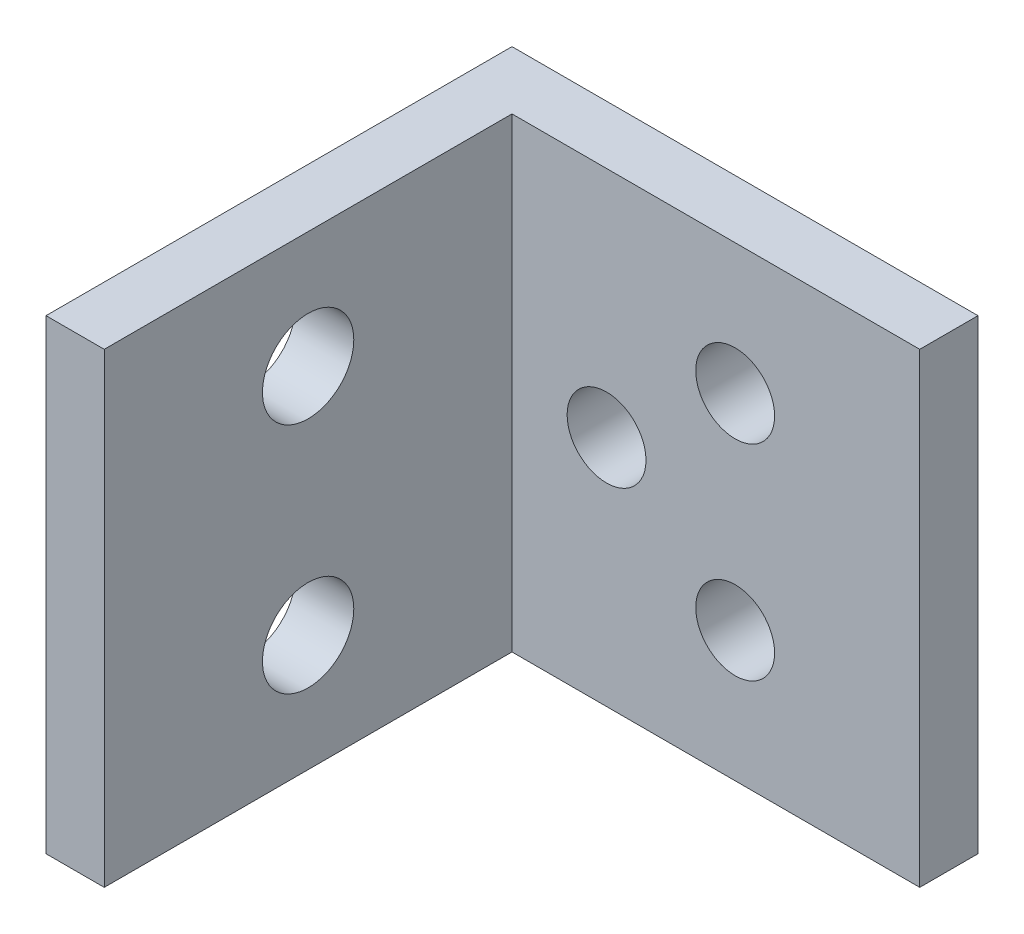
ISO-10303-21;
HEADER;
FILE_DESCRIPTION(('STEP AP214'),'2;1');
FILE_NAME('part.step','',(''),(''),'','','');
FILE_SCHEMA(('AUTOMOTIVE_DESIGN { 1 0 10303 214 1 1 1 1 }'));
ENDSEC;
DATA;
#1=APPLICATION_CONTEXT('core data for automotive mechanical design processes');
#2=APPLICATION_PROTOCOL_DEFINITION('international standard','automotive_design',2000,#1);
#3=PRODUCT_CONTEXT('',#1,'mechanical');
#4=PRODUCT('Part','Part','',(#3));
#5=PRODUCT_RELATED_PRODUCT_CATEGORY('part','',(#4));
#6=PRODUCT_DEFINITION_FORMATION('','',#4);
#7=PRODUCT_DEFINITION_CONTEXT('part definition',#1,'design');
#8=PRODUCT_DEFINITION('design','',#6,#7);
#9=PRODUCT_DEFINITION_SHAPE('','',#8);
#10=(LENGTH_UNIT() NAMED_UNIT(*) SI_UNIT(.MILLI.,.METRE.));
#11=(NAMED_UNIT(*) PLANE_ANGLE_UNIT() SI_UNIT($,.RADIAN.));
#12=(NAMED_UNIT(*) SI_UNIT($,.STERADIAN.) SOLID_ANGLE_UNIT());
#13=UNCERTAINTY_MEASURE_WITH_UNIT(LENGTH_MEASURE(1.E-05),#10,'distance_accuracy_value','');
#14=(GEOMETRIC_REPRESENTATION_CONTEXT(3) GLOBAL_UNCERTAINTY_ASSIGNED_CONTEXT((#13)) GLOBAL_UNIT_ASSIGNED_CONTEXT((#10,
#11,#12)) REPRESENTATION_CONTEXT('',''));
#15=CARTESIAN_POINT('',(0.,0.,0.));
#16=DIRECTION('',(0.,0.,1.));
#17=DIRECTION('',(1.,0.,0.));
#18=AXIS2_PLACEMENT_3D('',#15,#16,#17);
#19=CARTESIAN_POINT('',(0.,25.4,0.));
#20=DIRECTION('',(1.,0.,0.));
#21=DIRECTION('',(0.,0.,-1.));
#22=AXIS2_PLACEMENT_3D('',#19,#20,#21);
#23=PLANE('',#22);
#24=CARTESIAN_POINT('',(0.,6.35,14.2875));
#25=DIRECTION('',(1.,0.,0.));
#26=DIRECTION('',(0.,0.,-1.));
#27=AXIS2_PLACEMENT_3D('',#24,#25,#26);
#28=CIRCLE('',#27,2.4892);
#29=CARTESIAN_POINT('',(0.,6.35,11.7983));
#30=VERTEX_POINT('',#29);
#31=EDGE_CURVE('E183',#30,#30,#28,.T.);
#32=ORIENTED_EDGE('',*,*,#31,.T.);
#33=EDGE_LOOP('',(#32));
#34=FACE_BOUND('',#33,.T.);
#35=CARTESIAN_POINT('',(0.,19.05,14.2875));
#36=DIRECTION('',(1.,0.,0.));
#37=DIRECTION('',(0.,0.,-1.));
#38=AXIS2_PLACEMENT_3D('',#35,#36,#37);
#39=CIRCLE('',#38,2.4892);
#40=CARTESIAN_POINT('',(0.,19.05,11.7983));
#41=VERTEX_POINT('',#40);
#42=EDGE_CURVE('E186',#41,#41,#39,.T.);
#43=ORIENTED_EDGE('',*,*,#42,.T.);
#44=EDGE_LOOP('',(#43));
#45=FACE_BOUND('',#44,.T.);
#46=DIRECTION('',(0.,0.,1.));
#47=VECTOR('',#46,1.);
#48=CARTESIAN_POINT('',(0.,0.,0.));
#49=LINE('',#48,#47);
#50=CARTESIAN_POINT('',(0.,0.,0.));
#51=VERTEX_POINT('',#50);
#52=CARTESIAN_POINT('',(0.,0.,25.4));
#53=VERTEX_POINT('',#52);
#54=EDGE_CURVE('E125',#51,#53,#49,.T.);
#55=ORIENTED_EDGE('',*,*,#54,.T.);
#56=DIRECTION('',(0.,-1.,0.));
#57=VECTOR('',#56,1.);
#58=CARTESIAN_POINT('',(0.,25.4,25.4));
#59=LINE('',#58,#57);
#60=CARTESIAN_POINT('',(0.,25.4,25.4));
#61=VERTEX_POINT('',#60);
#62=EDGE_CURVE('E11',#61,#53,#59,.T.);
#63=ORIENTED_EDGE('',*,*,#62,.F.);
#64=DIRECTION('',(0.,0.,1.));
#65=VECTOR('',#64,1.);
#66=CARTESIAN_POINT('',(0.,25.4,0.));
#67=LINE('',#66,#65);
#68=CARTESIAN_POINT('',(0.,25.4,0.));
#69=VERTEX_POINT('',#68);
#70=EDGE_CURVE('E86',#69,#61,#67,.T.);
#71=ORIENTED_EDGE('',*,*,#70,.F.);
#72=DIRECTION('',(0.,-1.,0.));
#73=VECTOR('',#72,1.);
#74=CARTESIAN_POINT('',(0.,25.4,0.));
#75=LINE('',#74,#73);
#76=EDGE_CURVE('E121',#69,#51,#75,.T.);
#77=ORIENTED_EDGE('',*,*,#76,.T.);
#78=EDGE_LOOP('',(#55,#63,#71,#77));
#79=FACE_BOUND('',#78,.T.);
#80=ADVANCED_FACE('F39',(#34,#45,#79),#23,.F.);
#81=CARTESIAN_POINT('',(3.175,25.4,25.4));
#82=DIRECTION('',(0.,0.,1.));
#83=DIRECTION('',(1.,0.,0.));
#84=AXIS2_PLACEMENT_3D('',#81,#82,#83);
#85=PLANE('',#84);
#86=DIRECTION('',(-1.,0.,0.));
#87=VECTOR('',#86,1.);
#88=CARTESIAN_POINT('',(3.175,0.,25.4));
#89=LINE('',#88,#87);
#90=CARTESIAN_POINT('',(3.175,0.,25.4));
#91=VERTEX_POINT('',#90);
#92=EDGE_CURVE('E129',#91,#53,#89,.T.);
#93=ORIENTED_EDGE('',*,*,#92,.F.);
#94=DIRECTION('',(0.,-1.,0.));
#95=VECTOR('',#94,1.);
#96=CARTESIAN_POINT('',(3.175,25.4,25.4));
#97=LINE('',#96,#95);
#98=CARTESIAN_POINT('',(3.175,25.4,25.4));
#99=VERTEX_POINT('',#98);
#100=EDGE_CURVE('E48',#99,#91,#97,.T.);
#101=ORIENTED_EDGE('',*,*,#100,.F.);
#102=DIRECTION('',(-1.,0.,0.));
#103=VECTOR('',#102,1.);
#104=CARTESIAN_POINT('',(3.175,25.4,25.4));
#105=LINE('',#104,#103);
#106=EDGE_CURVE('E225',#99,#61,#105,.T.);
#107=ORIENTED_EDGE('',*,*,#106,.T.);
#108=ORIENTED_EDGE('',*,*,#62,.T.);
#109=EDGE_LOOP('',(#93,#101,#107,#108));
#110=FACE_BOUND('',#109,.T.);
#111=ADVANCED_FACE('F157',(#110),#85,.T.);
#112=CARTESIAN_POINT('',(3.175,25.4,0.));
#113=DIRECTION('',(1.,0.,0.));
#114=DIRECTION('',(0.,0.,-1.));
#115=AXIS2_PLACEMENT_3D('',#112,#113,#114);
#116=PLANE('',#115);
#117=CARTESIAN_POINT('',(3.175,6.35,14.2875));
#118=DIRECTION('',(1.,0.,0.));
#119=DIRECTION('',(0.,0.,-1.));
#120=AXIS2_PLACEMENT_3D('',#117,#118,#119);
#121=CIRCLE('',#120,2.4892);
#122=CARTESIAN_POINT('',(3.175,6.35,11.7983));
#123=VERTEX_POINT('',#122);
#124=EDGE_CURVE('E189',#123,#123,#121,.T.);
#125=ORIENTED_EDGE('',*,*,#124,.F.);
#126=EDGE_LOOP('',(#125));
#127=FACE_BOUND('',#126,.T.);
#128=CARTESIAN_POINT('',(3.175,19.05,14.2875));
#129=DIRECTION('',(1.,0.,0.));
#130=DIRECTION('',(0.,0.,-1.));
#131=AXIS2_PLACEMENT_3D('',#128,#129,#130);
#132=CIRCLE('',#131,2.4892);
#133=CARTESIAN_POINT('',(3.175,19.05,11.7983));
#134=VERTEX_POINT('',#133);
#135=EDGE_CURVE('E190',#134,#134,#132,.T.);
#136=ORIENTED_EDGE('',*,*,#135,.F.);
#137=EDGE_LOOP('',(#136));
#138=FACE_BOUND('',#137,.T.);
#139=DIRECTION('',(0.,0.,-1.));
#140=VECTOR('',#139,1.);
#141=CARTESIAN_POINT('',(3.175,0.,0.));
#142=LINE('',#141,#140);
#143=CARTESIAN_POINT('',(3.175,0.,3.175));
#144=VERTEX_POINT('',#143);
#145=EDGE_CURVE('E134',#144,#91,#142,.F.);
#146=ORIENTED_EDGE('',*,*,#145,.F.);
#147=DIRECTION('',(0.,-1.,0.));
#148=VECTOR('',#147,1.);
#149=CARTESIAN_POINT('',(3.175,25.4,3.175));
#150=LINE('',#149,#148);
#151=CARTESIAN_POINT('',(3.175,25.4,3.175));
#152=VERTEX_POINT('',#151);
#153=EDGE_CURVE('E108',#152,#144,#150,.T.);
#154=ORIENTED_EDGE('',*,*,#153,.F.);
#155=DIRECTION('',(0.,0.,-1.));
#156=VECTOR('',#155,1.);
#157=CARTESIAN_POINT('',(3.175,25.4,0.));
#158=LINE('',#157,#156);
#159=EDGE_CURVE('E114',#152,#99,#158,.F.);
#160=ORIENTED_EDGE('',*,*,#159,.T.);
#161=ORIENTED_EDGE('',*,*,#100,.T.);
#162=EDGE_LOOP('',(#146,#154,#160,#161));
#163=FACE_BOUND('',#162,.T.);
#164=ADVANCED_FACE('F154',(#127,#138,#163),#116,.T.);
#165=CARTESIAN_POINT('',(0.,25.4,3.175));
#166=DIRECTION('',(0.,0.,1.));
#167=DIRECTION('',(1.,0.,0.));
#168=AXIS2_PLACEMENT_3D('',#165,#166,#167);
#169=PLANE('',#168);
#170=CARTESIAN_POINT('',(8.32866,12.7,3.175));
#171=DIRECTION('',(0.,0.,1.));
#172=DIRECTION('',(1.,0.,0.));
#173=AXIS2_PLACEMENT_3D('',#170,#171,#172);
#174=CIRCLE('',#173,2.14884);
#175=CARTESIAN_POINT('',(10.4775,12.7,3.175));
#176=VERTEX_POINT('',#175);
#177=EDGE_CURVE('E130',#176,#176,#174,.T.);
#178=ORIENTED_EDGE('',*,*,#177,.F.);
#179=EDGE_LOOP('',(#178));
#180=FACE_BOUND('',#179,.T.);
#181=CARTESIAN_POINT('',(15.33906,7.10946,3.175));
#182=DIRECTION('',(0.,0.,1.));
#183=DIRECTION('',(1.,0.,0.));
#184=AXIS2_PLACEMENT_3D('',#181,#182,#183);
#185=CIRCLE('',#184,2.14884);
#186=CARTESIAN_POINT('',(17.4879,7.10946,3.175));
#187=VERTEX_POINT('',#186);
#188=EDGE_CURVE('E216',#187,#187,#185,.T.);
#189=ORIENTED_EDGE('',*,*,#188,.F.);
#190=EDGE_LOOP('',(#189));
#191=FACE_BOUND('',#190,.T.);
#192=CARTESIAN_POINT('',(15.33906,18.29054,3.175));
#193=DIRECTION('',(0.,0.,1.));
#194=DIRECTION('',(1.,0.,0.));
#195=AXIS2_PLACEMENT_3D('',#192,#193,#194);
#196=CIRCLE('',#195,2.14884);
#197=CARTESIAN_POINT('',(17.4879,18.29054,3.175));
#198=VERTEX_POINT('',#197);
#199=EDGE_CURVE('E204',#198,#198,#196,.T.);
#200=ORIENTED_EDGE('',*,*,#199,.F.);
#201=EDGE_LOOP('',(#200));
#202=FACE_BOUND('',#201,.T.);
#203=DIRECTION('',(1.,0.,0.));
#204=VECTOR('',#203,1.);
#205=CARTESIAN_POINT('',(0.,0.,3.175));
#206=LINE('',#205,#204);
#207=CARTESIAN_POINT('',(25.4,0.,3.175));
#208=VERTEX_POINT('',#207);
#209=EDGE_CURVE('E102',#208,#144,#206,.F.);
#210=ORIENTED_EDGE('',*,*,#209,.F.);
#211=DIRECTION('',(0.,-1.,0.));
#212=VECTOR('',#211,1.);
#213=CARTESIAN_POINT('',(25.4,25.4,3.175));
#214=LINE('',#213,#212);
#215=CARTESIAN_POINT('',(25.4,25.4,3.175));
#216=VERTEX_POINT('',#215);
#217=EDGE_CURVE('E97',#216,#208,#214,.T.);
#218=ORIENTED_EDGE('',*,*,#217,.F.);
#219=DIRECTION('',(1.,0.,0.));
#220=VECTOR('',#219,1.);
#221=CARTESIAN_POINT('',(0.,25.4,3.175));
#222=LINE('',#221,#220);
#223=EDGE_CURVE('E100',#216,#152,#222,.F.);
#224=ORIENTED_EDGE('',*,*,#223,.T.);
#225=ORIENTED_EDGE('',*,*,#153,.T.);
#226=EDGE_LOOP('',(#210,#218,#224,#225));
#227=FACE_BOUND('',#226,.T.);
#228=ADVANCED_FACE('F99',(#180,#191,#202,#227),#169,.T.);
#229=CARTESIAN_POINT('',(25.4,25.4,0.));
#230=DIRECTION('',(1.,0.,0.));
#231=DIRECTION('',(0.,0.,-1.));
#232=AXIS2_PLACEMENT_3D('',#229,#230,#231);
#233=PLANE('',#232);
#234=DIRECTION('',(0.,0.,1.));
#235=VECTOR('',#234,1.);
#236=CARTESIAN_POINT('',(25.4,0.,0.));
#237=LINE('',#236,#235);
#238=CARTESIAN_POINT('',(25.4,0.,0.));
#239=VERTEX_POINT('',#238);
#240=EDGE_CURVE('E140',#239,#208,#237,.T.);
#241=ORIENTED_EDGE('',*,*,#240,.F.);
#242=DIRECTION('',(0.,-1.,0.));
#243=VECTOR('',#242,1.);
#244=CARTESIAN_POINT('',(25.4,25.4,0.));
#245=LINE('',#244,#243);
#246=CARTESIAN_POINT('',(25.4,25.4,0.));
#247=VERTEX_POINT('',#246);
#248=EDGE_CURVE('E77',#247,#239,#245,.T.);
#249=ORIENTED_EDGE('',*,*,#248,.F.);
#250=DIRECTION('',(0.,0.,1.));
#251=VECTOR('',#250,1.);
#252=CARTESIAN_POINT('',(25.4,25.4,0.));
#253=LINE('',#252,#251);
#254=EDGE_CURVE('E112',#247,#216,#253,.T.);
#255=ORIENTED_EDGE('',*,*,#254,.T.);
#256=ORIENTED_EDGE('',*,*,#217,.T.);
#257=EDGE_LOOP('',(#241,#249,#255,#256));
#258=FACE_BOUND('',#257,.T.);
#259=ADVANCED_FACE('F117',(#258),#233,.T.);
#260=CARTESIAN_POINT('',(0.,25.4,0.));
#261=DIRECTION('',(0.,0.,1.));
#262=DIRECTION('',(1.,0.,0.));
#263=AXIS2_PLACEMENT_3D('',#260,#261,#262);
#264=PLANE('',#263);
#265=CARTESIAN_POINT('',(8.32866,12.7,0.));
#266=DIRECTION('',(0.,0.,-1.));
#267=DIRECTION('',(-1.,0.,0.));
#268=AXIS2_PLACEMENT_3D('',#265,#266,#267);
#269=CIRCLE('',#268,2.14884);
#270=CARTESIAN_POINT('',(6.17982,12.7,0.));
#271=VERTEX_POINT('',#270);
#272=EDGE_CURVE('E200',#271,#271,#269,.T.);
#273=ORIENTED_EDGE('',*,*,#272,.F.);
#274=EDGE_LOOP('',(#273));
#275=FACE_BOUND('',#274,.T.);
#276=CARTESIAN_POINT('',(15.33906,7.10946,0.));
#277=DIRECTION('',(0.,0.,-1.));
#278=DIRECTION('',(-1.,0.,0.));
#279=AXIS2_PLACEMENT_3D('',#276,#277,#278);
#280=CIRCLE('',#279,2.14884);
#281=CARTESIAN_POINT('',(13.19022,7.10946,0.));
#282=VERTEX_POINT('',#281);
#283=EDGE_CURVE('E205',#282,#282,#280,.T.);
#284=ORIENTED_EDGE('',*,*,#283,.F.);
#285=EDGE_LOOP('',(#284));
#286=FACE_BOUND('',#285,.T.);
#287=CARTESIAN_POINT('',(15.33906,18.29054,0.));
#288=DIRECTION('',(0.,0.,-1.));
#289=DIRECTION('',(-1.,0.,0.));
#290=AXIS2_PLACEMENT_3D('',#287,#288,#289);
#291=CIRCLE('',#290,2.14884);
#292=CARTESIAN_POINT('',(13.19022,18.29054,0.));
#293=VERTEX_POINT('',#292);
#294=EDGE_CURVE('E209',#293,#293,#291,.T.);
#295=ORIENTED_EDGE('',*,*,#294,.F.);
#296=EDGE_LOOP('',(#295));
#297=FACE_BOUND('',#296,.T.);
#298=DIRECTION('',(-1.,0.,0.));
#299=VECTOR('',#298,1.);
#300=CARTESIAN_POINT('',(0.,0.,0.));
#301=LINE('',#300,#299);
#302=EDGE_CURVE('E80',#239,#51,#301,.T.);
#303=ORIENTED_EDGE('',*,*,#302,.T.);
#304=ORIENTED_EDGE('',*,*,#76,.F.);
#305=DIRECTION('',(-1.,0.,0.));
#306=VECTOR('',#305,1.);
#307=CARTESIAN_POINT('',(0.,25.4,0.));
#308=LINE('',#307,#306);
#309=EDGE_CURVE('E56',#247,#69,#308,.T.);
#310=ORIENTED_EDGE('',*,*,#309,.F.);
#311=ORIENTED_EDGE('',*,*,#248,.T.);
#312=EDGE_LOOP('',(#303,#304,#310,#311));
#313=FACE_BOUND('',#312,.T.);
#314=ADVANCED_FACE('F162',(#275,#286,#297,#313),#264,.F.);
#315=CARTESIAN_POINT('',(0.,25.4,0.));
#316=DIRECTION('',(0.,-1.,0.));
#317=DIRECTION('',(-1.,0.,0.));
#318=AXIS2_PLACEMENT_3D('',#315,#316,#317);
#319=PLANE('',#318);
#320=ORIENTED_EDGE('',*,*,#70,.T.);
#321=ORIENTED_EDGE('',*,*,#106,.F.);
#322=ORIENTED_EDGE('',*,*,#159,.F.);
#323=ORIENTED_EDGE('',*,*,#223,.F.);
#324=ORIENTED_EDGE('',*,*,#254,.F.);
#325=ORIENTED_EDGE('',*,*,#309,.T.);
#326=EDGE_LOOP('',(#320,#321,#322,#323,#324,#325));
#327=FACE_BOUND('',#326,.T.);
#328=ADVANCED_FACE('F111',(#327),#319,.F.);
#329=CARTESIAN_POINT('',(0.,0.,0.));
#330=DIRECTION('',(0.,-1.,0.));
#331=DIRECTION('',(-1.,0.,0.));
#332=AXIS2_PLACEMENT_3D('',#329,#330,#331);
#333=PLANE('',#332);
#334=ORIENTED_EDGE('',*,*,#54,.F.);
#335=ORIENTED_EDGE('',*,*,#302,.F.);
#336=ORIENTED_EDGE('',*,*,#240,.T.);
#337=ORIENTED_EDGE('',*,*,#209,.T.);
#338=ORIENTED_EDGE('',*,*,#145,.T.);
#339=ORIENTED_EDGE('',*,*,#92,.T.);
#340=EDGE_LOOP('',(#334,#335,#336,#337,#338,#339));
#341=FACE_BOUND('',#340,.T.);
#342=ADVANCED_FACE('F160',(#341),#333,.T.);
#343=CARTESIAN_POINT('',(15.33906,18.29054,25.4));
#344=DIRECTION('',(0.,0.,-1.));
#345=DIRECTION('',(-1.,0.,0.));
#346=AXIS2_PLACEMENT_3D('',#343,#344,#345);
#347=CYLINDRICAL_SURFACE('',#346,2.14884);
#348=ORIENTED_EDGE('',*,*,#199,.T.);
#349=EDGE_LOOP('',(#348));
#350=FACE_BOUND('',#349,.T.);
#351=ORIENTED_EDGE('',*,*,#294,.T.);
#352=EDGE_LOOP('',(#351));
#353=FACE_BOUND('',#352,.T.);
#354=ADVANCED_FACE('F241',(#350,#353),#347,.F.);
#355=CARTESIAN_POINT('',(15.33906,7.10946,25.4));
#356=DIRECTION('',(0.,0.,-1.));
#357=DIRECTION('',(-1.,0.,0.));
#358=AXIS2_PLACEMENT_3D('',#355,#356,#357);
#359=CYLINDRICAL_SURFACE('',#358,2.14884);
#360=ORIENTED_EDGE('',*,*,#188,.T.);
#361=EDGE_LOOP('',(#360));
#362=FACE_BOUND('',#361,.T.);
#363=ORIENTED_EDGE('',*,*,#283,.T.);
#364=EDGE_LOOP('',(#363));
#365=FACE_BOUND('',#364,.T.);
#366=ADVANCED_FACE('F244',(#362,#365),#359,.F.);
#367=CARTESIAN_POINT('',(8.32866,12.7,25.4));
#368=DIRECTION('',(0.,0.,-1.));
#369=DIRECTION('',(-1.,0.,0.));
#370=AXIS2_PLACEMENT_3D('',#367,#368,#369);
#371=CYLINDRICAL_SURFACE('',#370,2.14884);
#372=ORIENTED_EDGE('',*,*,#177,.T.);
#373=EDGE_LOOP('',(#372));
#374=FACE_BOUND('',#373,.T.);
#375=ORIENTED_EDGE('',*,*,#272,.T.);
#376=EDGE_LOOP('',(#375));
#377=FACE_BOUND('',#376,.T.);
#378=ADVANCED_FACE('F231',(#374,#377),#371,.F.);
#379=CARTESIAN_POINT('',(0.,19.05,14.2875));
#380=DIRECTION('',(1.,0.,0.));
#381=DIRECTION('',(0.,0.,-1.));
#382=AXIS2_PLACEMENT_3D('',#379,#380,#381);
#383=CYLINDRICAL_SURFACE('',#382,2.4892);
#384=ORIENTED_EDGE('',*,*,#42,.F.);
#385=EDGE_LOOP('',(#384));
#386=FACE_BOUND('',#385,.T.);
#387=ORIENTED_EDGE('',*,*,#135,.T.);
#388=EDGE_LOOP('',(#387));
#389=FACE_BOUND('',#388,.T.);
#390=ADVANCED_FACE('F257',(#386,#389),#383,.F.);
#391=CARTESIAN_POINT('',(0.,6.35,14.2875));
#392=DIRECTION('',(1.,0.,0.));
#393=DIRECTION('',(0.,0.,-1.));
#394=AXIS2_PLACEMENT_3D('',#391,#392,#393);
#395=CYLINDRICAL_SURFACE('',#394,2.4892);
#396=ORIENTED_EDGE('',*,*,#31,.F.);
#397=EDGE_LOOP('',(#396));
#398=FACE_BOUND('',#397,.T.);
#399=ORIENTED_EDGE('',*,*,#124,.T.);
#400=EDGE_LOOP('',(#399));
#401=FACE_BOUND('',#400,.T.);
#402=ADVANCED_FACE('F260',(#398,#401),#395,.F.);
#403=CLOSED_SHELL('',(#80,#111,#164,#228,#259,#314,#328,#342,#354,#366,#378,#390,#402));
#404=MANIFOLD_SOLID_BREP('B2',#403);
#405=ADVANCED_BREP_SHAPE_REPRESENTATION('',(#18,#404),#14);
#406=SHAPE_DEFINITION_REPRESENTATION(#9,#405);
ENDSEC;
END-ISO-10303-21;
